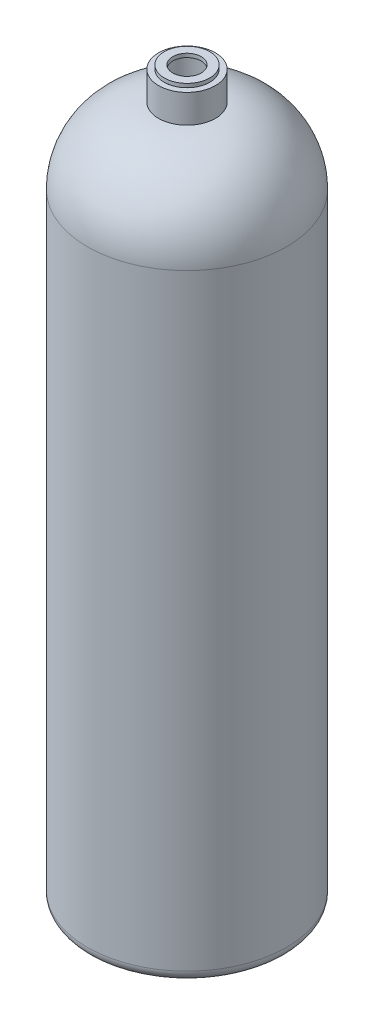
ISO-10303-21;
HEADER;
FILE_DESCRIPTION(('STEP AP214'),'2;1');
FILE_NAME('part.step','',(''),(''),'','','');
FILE_SCHEMA(('AUTOMOTIVE_DESIGN { 1 0 10303 214 1 1 1 1 }'));
ENDSEC;
DATA;
#1=APPLICATION_CONTEXT('core data for automotive mechanical design processes');
#2=APPLICATION_PROTOCOL_DEFINITION('international standard','automotive_design',2000,#1);
#3=PRODUCT_CONTEXT('',#1,'mechanical');
#4=PRODUCT('Part','Part','',(#3));
#5=PRODUCT_RELATED_PRODUCT_CATEGORY('part','',(#4));
#6=PRODUCT_DEFINITION_FORMATION('','',#4);
#7=PRODUCT_DEFINITION_CONTEXT('part definition',#1,'design');
#8=PRODUCT_DEFINITION('design','',#6,#7);
#9=PRODUCT_DEFINITION_SHAPE('','',#8);
#10=(LENGTH_UNIT() NAMED_UNIT(*) SI_UNIT(.MILLI.,.METRE.));
#11=(NAMED_UNIT(*) PLANE_ANGLE_UNIT() SI_UNIT($,.RADIAN.));
#12=(NAMED_UNIT(*) SI_UNIT($,.STERADIAN.) SOLID_ANGLE_UNIT());
#13=UNCERTAINTY_MEASURE_WITH_UNIT(LENGTH_MEASURE(1.E-05),#10,'distance_accuracy_value','');
#14=(GEOMETRIC_REPRESENTATION_CONTEXT(3) GLOBAL_UNCERTAINTY_ASSIGNED_CONTEXT((#13)) GLOBAL_UNIT_ASSIGNED_CONTEXT((#10,
#11,#12)) REPRESENTATION_CONTEXT('',''));
#15=CARTESIAN_POINT('',(0.,0.,0.));
#16=DIRECTION('',(0.,0.,1.));
#17=DIRECTION('',(1.,0.,0.));
#18=AXIS2_PLACEMENT_3D('',#15,#16,#17);
#19=CARTESIAN_POINT('',(0.,486.41,0.));
#20=DIRECTION('',(0.,1.,0.));
#21=DIRECTION('',(0.,0.,1.));
#22=AXIS2_PLACEMENT_3D('',#19,#20,#21);
#23=PLANE('',#22);
#24=CARTESIAN_POINT('',(0.,486.41,0.));
#25=DIRECTION('',(0.,1.,0.));
#26=DIRECTION('',(0.,0.,1.));
#27=AXIS2_PLACEMENT_3D('',#24,#25,#26);
#28=CIRCLE('',#27,15.24);
#29=CARTESIAN_POINT('',(0.,486.41,15.24));
#30=VERTEX_POINT('',#29);
#31=EDGE_CURVE('E11',#30,#30,#28,.T.);
#32=ORIENTED_EDGE('',*,*,#31,.T.);
#33=EDGE_LOOP('',(#32));
#34=FACE_BOUND('',#33,.T.);
#35=CARTESIAN_POINT('',(0.,486.41,0.));
#36=DIRECTION('',(0.,1.,0.));
#37=DIRECTION('',(0.,0.,1.));
#38=AXIS2_PLACEMENT_3D('',#35,#36,#37);
#39=CIRCLE('',#38,9.525);
#40=CARTESIAN_POINT('',(0.,486.41,9.525));
#41=VERTEX_POINT('',#40);
#42=EDGE_CURVE('E52',#41,#41,#39,.T.);
#43=ORIENTED_EDGE('',*,*,#42,.F.);
#44=EDGE_LOOP('',(#43));
#45=FACE_BOUND('',#44,.T.);
#46=ADVANCED_FACE('F41',(#34,#45),#23,.T.);
#47=CARTESIAN_POINT('',(0.,483.87,0.));
#48=DIRECTION('',(0.,1.,0.));
#49=DIRECTION('',(0.,0.,1.));
#50=AXIS2_PLACEMENT_3D('',#47,#48,#49);
#51=PLANE('',#50);
#52=CARTESIAN_POINT('',(0.,483.87,0.));
#53=DIRECTION('',(0.,1.,0.));
#54=DIRECTION('',(0.,0.,1.));
#55=AXIS2_PLACEMENT_3D('',#52,#53,#54);
#56=CIRCLE('',#55,15.24);
#57=CARTESIAN_POINT('',(0.,483.87,15.24));
#58=VERTEX_POINT('',#57);
#59=EDGE_CURVE('E45',#58,#58,#56,.T.);
#60=ORIENTED_EDGE('',*,*,#59,.F.);
#61=EDGE_LOOP('',(#60));
#62=FACE_BOUND('',#61,.T.);
#63=CARTESIAN_POINT('',(0.,483.87,0.));
#64=DIRECTION('',(0.,1.,0.));
#65=DIRECTION('',(0.,0.,1.));
#66=AXIS2_PLACEMENT_3D('',#63,#64,#65);
#67=CIRCLE('',#66,9.525);
#68=CARTESIAN_POINT('',(0.,483.87,9.525));
#69=VERTEX_POINT('',#68);
#70=EDGE_CURVE('E54',#69,#69,#67,.T.);
#71=ORIENTED_EDGE('',*,*,#70,.T.);
#72=EDGE_LOOP('',(#71));
#73=FACE_BOUND('',#72,.T.);
#74=ADVANCED_FACE('F64',(#62,#73),#51,.F.);
#75=CARTESIAN_POINT('',(0.,486.41,0.));
#76=DIRECTION('',(0.,-1.,0.));
#77=DIRECTION('',(0.,0.,-1.));
#78=AXIS2_PLACEMENT_3D('',#75,#76,#77);
#79=CYLINDRICAL_SURFACE('',#78,15.24);
#80=ORIENTED_EDGE('',*,*,#31,.F.);
#81=EDGE_LOOP('',(#80));
#82=FACE_BOUND('',#81,.T.);
#83=ORIENTED_EDGE('',*,*,#59,.T.);
#84=EDGE_LOOP('',(#83));
#85=FACE_BOUND('',#84,.T.);
#86=ADVANCED_FACE('F43',(#82,#85),#79,.T.);
#87=CARTESIAN_POINT('',(0.,486.41,0.));
#88=DIRECTION('',(0.,-1.,0.));
#89=DIRECTION('',(0.,0.,-1.));
#90=AXIS2_PLACEMENT_3D('',#87,#88,#89);
#91=CYLINDRICAL_SURFACE('',#90,9.525);
#92=ORIENTED_EDGE('',*,*,#42,.T.);
#93=EDGE_LOOP('',(#92));
#94=FACE_BOUND('',#93,.T.);
#95=ORIENTED_EDGE('',*,*,#70,.F.);
#96=EDGE_LOOP('',(#95));
#97=FACE_BOUND('',#96,.T.);
#98=ADVANCED_FACE('F60',(#94,#97),#91,.F.);
#99=CLOSED_SHELL('',(#46,#74,#86,#98));
#100=MANIFOLD_SOLID_BREP('B2',#99);
#101=CARTESIAN_POINT('',(0.,414.02,0.));
#102=DIRECTION('',(0.,-1.,0.));
#103=DIRECTION('',(0.,0.,-1.));
#104=AXIS2_PLACEMENT_3D('',#101,#102,#103);
#105=CYLINDRICAL_SURFACE('',#104,66.675);
#106=CARTESIAN_POINT('',(0.,7.62000000000002,0.));
#107=DIRECTION('',(0.,1.,0.));
#108=DIRECTION('',(0.,0.,1.));
#109=AXIS2_PLACEMENT_3D('',#106,#107,#108);
#110=CIRCLE('',#109,66.675);
#111=CARTESIAN_POINT('',(0.,7.62000000000002,66.675));
#112=VERTEX_POINT('',#111);
#113=EDGE_CURVE('E110',#112,#112,#110,.T.);
#114=ORIENTED_EDGE('',*,*,#113,.T.);
#115=EDGE_LOOP('',(#114));
#116=FACE_BOUND('',#115,.T.);
#117=CARTESIAN_POINT('',(0.,414.119315833019,0.));
#118=DIRECTION('',(0.,1.,0.));
#119=DIRECTION('',(0.,0.,1.));
#120=AXIS2_PLACEMENT_3D('',#117,#118,#119);
#121=CIRCLE('',#120,66.675);
#122=CARTESIAN_POINT('',(0.,414.119315833019,66.675));
#123=VERTEX_POINT('',#122);
#124=EDGE_CURVE('E114',#123,#123,#121,.F.);
#125=ORIENTED_EDGE('',*,*,#124,.T.);
#126=EDGE_LOOP('',(#125));
#127=FACE_BOUND('',#126,.T.);
#128=ADVANCED_FACE('F103',(#116,#127),#105,.T.);
#129=CARTESIAN_POINT('',(0.,0.,0.));
#130=DIRECTION('',(0.,1.,0.));
#131=DIRECTION('',(0.,0.,1.));
#132=AXIS2_PLACEMENT_3D('',#129,#130,#131);
#133=PLANE('',#132);
#134=CARTESIAN_POINT('',(0.,0.,0.));
#135=DIRECTION('',(0.,1.,0.));
#136=DIRECTION('',(0.,0.,1.));
#137=AXIS2_PLACEMENT_3D('',#134,#135,#136);
#138=CIRCLE('',#137,59.055);
#139=CARTESIAN_POINT('',(0.,0.,59.055));
#140=VERTEX_POINT('',#139);
#141=EDGE_CURVE('E40',#140,#140,#138,.F.);
#142=ORIENTED_EDGE('',*,*,#141,.T.);
#143=EDGE_LOOP('',(#142));
#144=FACE_BOUND('',#143,.T.);
#145=ADVANCED_FACE('F167',(#144),#133,.F.);
#146=CARTESIAN_POINT('',(0.,483.87,0.));
#147=DIRECTION('',(0.,-1.,0.));
#148=DIRECTION('',(0.,0.,-1.));
#149=AXIS2_PLACEMENT_3D('',#146,#147,#148);
#150=CYLINDRICAL_SURFACE('',#149,19.05);
#151=CARTESIAN_POINT('',(0.,483.87,0.));
#152=DIRECTION('',(0.,1.,0.));
#153=DIRECTION('',(0.,0.,1.));
#154=AXIS2_PLACEMENT_3D('',#151,#152,#153);
#155=CIRCLE('',#154,19.05);
#156=CARTESIAN_POINT('',(0.,483.87,-19.05));
#157=VERTEX_POINT('',#156);
#158=EDGE_CURVE('E118',#157,#157,#155,.T.);
#159=CARTESIAN_POINT('',(0.,464.82,0.));
#160=DIRECTION('',(0.,1.,0.));
#161=DIRECTION('',(0.,0.,1.));
#162=AXIS2_PLACEMENT_3D('',#159,#160,#161);
#163=CIRCLE('',#162,19.05);
#164=CARTESIAN_POINT('',(0.,464.82,-19.05));
#165=VERTEX_POINT('',#164);
#166=EDGE_CURVE('E121',#165,#165,#163,.T.);
#167=CARTESIAN_POINT('',(0.,483.87,-19.05));
#168=CARTESIAN_POINT('',(0.,483.6715625,-19.05));
#169=CARTESIAN_POINT('',(0.,483.473125,-19.05));
#170=CARTESIAN_POINT('',(0.,483.07625,-19.05));
#171=CARTESIAN_POINT('',(0.,482.8778125,-19.05));
#172=CARTESIAN_POINT('',(0.,482.4809375,-19.05));
#173=CARTESIAN_POINT('',(0.,482.2825,-19.05));
#174=CARTESIAN_POINT('',(0.,481.885625,-19.05));
#175=CARTESIAN_POINT('',(0.,481.6871875,-19.05));
#176=CARTESIAN_POINT('',(0.,481.2903125,-19.05));
#177=CARTESIAN_POINT('',(0.,481.091875,-19.05));
#178=CARTESIAN_POINT('',(0.,480.695,-19.05));
#179=CARTESIAN_POINT('',(0.,480.4965625,-19.05));
#180=CARTESIAN_POINT('',(0.,480.0996875,-19.05));
#181=CARTESIAN_POINT('',(0.,479.90125,-19.05));
#182=CARTESIAN_POINT('',(0.,479.504375,-19.05));
#183=CARTESIAN_POINT('',(0.,479.3059375,-19.05));
#184=CARTESIAN_POINT('',(0.,478.9090625,-19.05));
#185=CARTESIAN_POINT('',(0.,478.710625,-19.05));
#186=CARTESIAN_POINT('',(0.,478.31375,-19.05));
#187=CARTESIAN_POINT('',(0.,478.1153125,-19.05));
#188=CARTESIAN_POINT('',(0.,477.7184375,-19.05));
#189=CARTESIAN_POINT('',(0.,477.52,-19.05));
#190=CARTESIAN_POINT('',(0.,477.123125,-19.05));
#191=CARTESIAN_POINT('',(0.,476.9246875,-19.05));
#192=CARTESIAN_POINT('',(0.,476.5278125,-19.05));
#193=CARTESIAN_POINT('',(0.,476.329375,-19.05));
#194=CARTESIAN_POINT('',(0.,475.9325,-19.05));
#195=CARTESIAN_POINT('',(0.,475.7340625,-19.05));
#196=CARTESIAN_POINT('',(0.,475.3371875,-19.05));
#197=CARTESIAN_POINT('',(0.,475.13875,-19.05));
#198=CARTESIAN_POINT('',(0.,474.741875,-19.05));
#199=CARTESIAN_POINT('',(0.,474.5434375,-19.05));
#200=CARTESIAN_POINT('',(0.,474.1465625,-19.05));
#201=CARTESIAN_POINT('',(0.,473.948125,-19.05));
#202=CARTESIAN_POINT('',(0.,473.55125,-19.05));
#203=CARTESIAN_POINT('',(0.,473.3528125,-19.05));
#204=CARTESIAN_POINT('',(0.,472.9559375,-19.05));
#205=CARTESIAN_POINT('',(0.,472.7575,-19.05));
#206=CARTESIAN_POINT('',(0.,472.360625,-19.05));
#207=CARTESIAN_POINT('',(0.,472.1621875,-19.05));
#208=CARTESIAN_POINT('',(0.,471.7653125,-19.05));
#209=CARTESIAN_POINT('',(0.,471.566875,-19.05));
#210=CARTESIAN_POINT('',(0.,471.17,-19.05));
#211=CARTESIAN_POINT('',(0.,470.9715625,-19.05));
#212=CARTESIAN_POINT('',(0.,470.5746875,-19.05));
#213=CARTESIAN_POINT('',(0.,470.37625,-19.05));
#214=CARTESIAN_POINT('',(0.,469.979375,-19.05));
#215=CARTESIAN_POINT('',(0.,469.7809375,-19.05));
#216=CARTESIAN_POINT('',(0.,469.3840625,-19.05));
#217=CARTESIAN_POINT('',(0.,469.185625,-19.05));
#218=CARTESIAN_POINT('',(0.,468.78875,-19.05));
#219=CARTESIAN_POINT('',(0.,468.5903125,-19.05));
#220=CARTESIAN_POINT('',(0.,468.1934375,-19.05));
#221=CARTESIAN_POINT('',(0.,467.995,-19.05));
#222=CARTESIAN_POINT('',(0.,467.598125,-19.05));
#223=CARTESIAN_POINT('',(0.,467.3996875,-19.05));
#224=CARTESIAN_POINT('',(0.,467.0028125,-19.05));
#225=CARTESIAN_POINT('',(0.,466.804375,-19.05));
#226=CARTESIAN_POINT('',(0.,466.4075,-19.05));
#227=CARTESIAN_POINT('',(0.,466.2090625,-19.05));
#228=CARTESIAN_POINT('',(0.,465.8121875,-19.05));
#229=CARTESIAN_POINT('',(0.,465.61375,-19.05));
#230=CARTESIAN_POINT('',(0.,465.216875,-19.05));
#231=CARTESIAN_POINT('',(0.,465.0184375,-19.05));
#232=CARTESIAN_POINT('',(0.,464.82,-19.05));
#233=B_SPLINE_CURVE_WITH_KNOTS('',3,(#167,#168,#169,#170,#171,#172,#173,#174,#175,#176,#177,
#178,#179,#180,#181,#182,#183,#184,#185,#186,#187,#188,#189,#190,#191,#192,#193,#194,#195,#196,
#197,#198,#199,#200,#201,#202,#203,#204,#205,#206,#207,#208,#209,#210,#211,#212,#213,#214,#215,
#216,#217,#218,#219,#220,#221,#222,#223,#224,#225,#226,#227,#228,#229,#230,#231,#232),
.UNSPECIFIED.,.F.,.F.,(4,2,2,2,2,2,2,2,2,2,2,2,2,2,2,2,2,2,2,2,2,2,2,2,2,2,2,2,2,2,2,2,4),(0.,
0.595312500000056,1.19062500000006,1.78593750000006,2.38125000000006,2.97656250000006,
3.57187500000006,4.16718750000006,4.76250000000006,5.35781250000006,5.95312500000006,
6.54843750000006,7.14375000000006,7.73906250000006,8.33437500000006,8.92968750000006,
9.52500000000006,10.1203125000001,10.7156250000001,11.3109375000001,11.9062500000001,
12.5015625000001,13.0968750000001,13.6921875000001,14.2875000000001,14.8828125000001,
15.4781250000001,16.0734375000001,16.6687500000001,17.2640625000001,17.8593750000001,
18.4546875000001,19.0500000000001),.UNSPECIFIED.);
#234=EDGE_CURVE('BSEAM172',#157,#165,#233,.T.);
#235=ORIENTED_EDGE('',*,*,#158,.F.);
#236=ORIENTED_EDGE('',*,*,#166,.T.);
#237=ORIENTED_EDGE('',*,*,#234,.T.);
#238=ORIENTED_EDGE('',*,*,#234,.F.);
#239=EDGE_LOOP('',(#235,#237,#236,#238));
#240=FACE_BOUND('',#239,.T.);
#241=ADVANCED_FACE('F172',(#240),#150,.T.);
#242=CARTESIAN_POINT('',(0.,483.87,0.));
#243=DIRECTION('',(0.,1.,0.));
#244=DIRECTION('',(0.,0.,1.));
#245=AXIS2_PLACEMENT_3D('',#242,#243,#244);
#246=PLANE('',#245);
#247=CARTESIAN_POINT('',(0.,483.87,0.));
#248=DIRECTION('',(0.,1.,0.));
#249=DIRECTION('',(0.,0.,1.));
#250=AXIS2_PLACEMENT_3D('',#247,#248,#249);
#251=CIRCLE('',#250,15.24);
#252=CARTESIAN_POINT('',(0.,483.87,-15.24));
#253=VERTEX_POINT('',#252);
#254=EDGE_CURVE('E127',#253,#253,#251,.T.);
#255=ORIENTED_EDGE('',*,*,#254,.F.);
#256=EDGE_LOOP('',(#255));
#257=FACE_BOUND('',#256,.T.);
#258=ORIENTED_EDGE('',*,*,#158,.T.);
#259=EDGE_LOOP('',(#258));
#260=FACE_BOUND('',#259,.T.);
#261=ADVANCED_FACE('F178',(#257,#260),#246,.T.);
#262=CARTESIAN_POINT('',(0.,414.119315833019,0.));
#263=DIRECTION('',(0.,1.,0.));
#264=DIRECTION('',(0.,0.,1.));
#265=AXIS2_PLACEMENT_3D('',#262,#263,#264);
#266=DEGENERATE_TOROIDAL_SURFACE('',#265,15.875,50.8,.T.);
#267=ORIENTED_EDGE('',*,*,#124,.F.);
#268=EDGE_LOOP('',(#267));
#269=FACE_BOUND('',#268,.T.);
#270=ORIENTED_EDGE('',*,*,#166,.F.);
#271=EDGE_LOOP('',(#270));
#272=FACE_BOUND('',#271,.T.);
#273=ADVANCED_FACE('F176',(#269,#272),#266,.T.);
#274=CARTESIAN_POINT('',(0.,7.62000000000002,0.));
#275=DIRECTION('',(0.,1.,0.));
#276=DIRECTION('',(0.,0.,1.));
#277=AXIS2_PLACEMENT_3D('',#274,#275,#276);
#278=TOROIDAL_SURFACE('',#277,59.055,7.62);
#279=ORIENTED_EDGE('',*,*,#141,.F.);
#280=EDGE_LOOP('',(#279));
#281=FACE_BOUND('',#280,.T.);
#282=ORIENTED_EDGE('',*,*,#113,.F.);
#283=EDGE_LOOP('',(#282));
#284=FACE_BOUND('',#283,.T.);
#285=ADVANCED_FACE('F105',(#281,#284),#278,.T.);
#286=CARTESIAN_POINT('',(0.,414.02,0.));
#287=DIRECTION('',(0.,-1.,0.));
#288=DIRECTION('',(0.,0.,-1.));
#289=AXIS2_PLACEMENT_3D('',#286,#287,#288);
#290=CYLINDRICAL_SURFACE('',#289,62.865);
#291=CARTESIAN_POINT('',(0.,7.62000000000002,0.));
#292=DIRECTION('',(0.,-1.,0.));
#293=DIRECTION('',(0.,0.,-1.));
#294=AXIS2_PLACEMENT_3D('',#291,#292,#293);
#295=CIRCLE('',#294,62.865);
#296=CARTESIAN_POINT('',(0.,7.62000000000002,-62.865));
#297=VERTEX_POINT('',#296);
#298=EDGE_CURVE('E134',#297,#297,#295,.F.);
#299=ORIENTED_EDGE('',*,*,#298,.F.);
#300=EDGE_LOOP('',(#299));
#301=FACE_BOUND('',#300,.T.);
#302=CARTESIAN_POINT('',(0.,414.119315833019,0.));
#303=DIRECTION('',(0.,-1.,0.));
#304=DIRECTION('',(0.,0.,-1.));
#305=AXIS2_PLACEMENT_3D('',#302,#303,#304);
#306=CIRCLE('',#305,62.865);
#307=CARTESIAN_POINT('',(0.,414.119315833019,-62.865));
#308=VERTEX_POINT('',#307);
#309=EDGE_CURVE('E130',#308,#308,#306,.T.);
#310=ORIENTED_EDGE('',*,*,#309,.F.);
#311=EDGE_LOOP('',(#310));
#312=FACE_BOUND('',#311,.T.);
#313=ADVANCED_FACE('F144',(#301,#312),#290,.F.);
#314=CARTESIAN_POINT('',(0.,3.81,0.));
#315=DIRECTION('',(0.,1.,0.));
#316=DIRECTION('',(0.,0.,1.));
#317=AXIS2_PLACEMENT_3D('',#314,#315,#316);
#318=PLANE('',#317);
#319=CARTESIAN_POINT('',(0.,3.81000000000002,0.));
#320=DIRECTION('',(0.,1.,0.));
#321=DIRECTION('',(0.,0.,1.));
#322=AXIS2_PLACEMENT_3D('',#319,#320,#321);
#323=CIRCLE('',#322,59.055);
#324=CARTESIAN_POINT('',(0.,3.81000000000002,59.055));
#325=VERTEX_POINT('',#324);
#326=EDGE_CURVE('E124',#325,#325,#323,.F.);
#327=ORIENTED_EDGE('',*,*,#326,.F.);
#328=EDGE_LOOP('',(#327));
#329=FACE_BOUND('',#328,.T.);
#330=ADVANCED_FACE('F147',(#329),#318,.T.);
#331=CARTESIAN_POINT('',(0.,483.87,0.));
#332=DIRECTION('',(0.,-1.,0.));
#333=DIRECTION('',(0.,0.,-1.));
#334=AXIS2_PLACEMENT_3D('',#331,#332,#333);
#335=CYLINDRICAL_SURFACE('',#334,15.24);
#336=CARTESIAN_POINT('',(0.,461.105025096581,0.));
#337=DIRECTION('',(0.,-1.,0.));
#338=DIRECTION('',(0.,0.,-1.));
#339=AXIS2_PLACEMENT_3D('',#336,#337,#338);
#340=CIRCLE('',#339,15.24);
#341=CARTESIAN_POINT('',(0.,461.105025096581,-15.24));
#342=VERTEX_POINT('',#341);
#343=EDGE_CURVE('E131',#342,#342,#340,.F.);
#344=CARTESIAN_POINT('',(0.,483.87,-15.24));
#345=CARTESIAN_POINT('',(0.,483.632864844756,-15.24));
#346=CARTESIAN_POINT('',(0.,483.395729689512,-15.24));
#347=CARTESIAN_POINT('',(0.,482.921459379024,-15.24));
#348=CARTESIAN_POINT('',(0.,482.68432422378,-15.24));
#349=CARTESIAN_POINT('',(0.,482.210053913292,-15.24));
#350=CARTESIAN_POINT('',(0.,481.972918758048,-15.24));
#351=CARTESIAN_POINT('',(0.,481.498648447561,-15.24));
#352=CARTESIAN_POINT('',(0.,481.261513292317,-15.24));
#353=CARTESIAN_POINT('',(0.,480.787242981829,-15.24));
#354=CARTESIAN_POINT('',(0.,480.550107826585,-15.24));
#355=CARTESIAN_POINT('',(0.,480.075837516097,-15.24));
#356=CARTESIAN_POINT('',(0.,479.838702360853,-15.24));
#357=CARTESIAN_POINT('',(0.,479.364432050365,-15.24));
#358=CARTESIAN_POINT('',(0.,479.127296895121,-15.24));
#359=CARTESIAN_POINT('',(0.,478.653026584633,-15.24));
#360=CARTESIAN_POINT('',(0.,478.415891429389,-15.24));
#361=CARTESIAN_POINT('',(0.,477.941621118901,-15.24));
#362=CARTESIAN_POINT('',(0.,477.704485963657,-15.24));
#363=CARTESIAN_POINT('',(0.,477.230215653169,-15.24));
#364=CARTESIAN_POINT('',(0.,476.993080497925,-15.24));
#365=CARTESIAN_POINT('',(0.,476.518810187438,-15.24));
#366=CARTESIAN_POINT('',(0.,476.281675032194,-15.24));
#367=CARTESIAN_POINT('',(0.,475.807404721706,-15.24));
#368=CARTESIAN_POINT('',(0.,475.570269566462,-15.24));
#369=CARTESIAN_POINT('',(0.,475.095999255974,-15.24));
#370=CARTESIAN_POINT('',(0.,474.85886410073,-15.24));
#371=CARTESIAN_POINT('',(0.,474.384593790242,-15.24));
#372=CARTESIAN_POINT('',(0.,474.147458634998,-15.24));
#373=CARTESIAN_POINT('',(0.,473.67318832451,-15.24));
#374=CARTESIAN_POINT('',(0.,473.436053169266,-15.24));
#375=CARTESIAN_POINT('',(0.,472.961782858778,-15.24));
#376=CARTESIAN_POINT('',(0.,472.724647703534,-15.24));
#377=CARTESIAN_POINT('',(0.,472.250377393047,-15.24));
#378=CARTESIAN_POINT('',(0.,472.013242237803,-15.24));
#379=CARTESIAN_POINT('',(0.,471.538971927315,-15.24));
#380=CARTESIAN_POINT('',(0.,471.301836772071,-15.24));
#381=CARTESIAN_POINT('',(0.,470.827566461583,-15.24));
#382=CARTESIAN_POINT('',(0.,470.590431306339,-15.24));
#383=CARTESIAN_POINT('',(0.,470.116160995851,-15.24));
#384=CARTESIAN_POINT('',(0.,469.879025840607,-15.24));
#385=CARTESIAN_POINT('',(0.,469.404755530119,-15.24));
#386=CARTESIAN_POINT('',(0.,469.167620374875,-15.24));
#387=CARTESIAN_POINT('',(0.,468.693350064387,-15.24));
#388=CARTESIAN_POINT('',(0.,468.456214909143,-15.24));
#389=CARTESIAN_POINT('',(0.,467.981944598655,-15.24));
#390=CARTESIAN_POINT('',(0.,467.744809443411,-15.24));
#391=CARTESIAN_POINT('',(0.,467.270539132924,-15.24));
#392=CARTESIAN_POINT('',(0.,467.03340397768,-15.24));
#393=CARTESIAN_POINT('',(0.,466.559133667192,-15.24));
#394=CARTESIAN_POINT('',(0.,466.321998511948,-15.24));
#395=CARTESIAN_POINT('',(0.,465.84772820146,-15.24));
#396=CARTESIAN_POINT('',(0.,465.610593046216,-15.24));
#397=CARTESIAN_POINT('',(0.,465.136322735728,-15.24));
#398=CARTESIAN_POINT('',(0.,464.899187580484,-15.24));
#399=CARTESIAN_POINT('',(0.,464.424917269996,-15.24));
#400=CARTESIAN_POINT('',(0.,464.187782114752,-15.24));
#401=CARTESIAN_POINT('',(0.,463.713511804264,-15.24));
#402=CARTESIAN_POINT('',(0.,463.47637664902,-15.24));
#403=CARTESIAN_POINT('',(0.,463.002106338532,-15.24));
#404=CARTESIAN_POINT('',(0.,462.764971183289,-15.24));
#405=CARTESIAN_POINT('',(0.,462.290700872801,-15.24));
#406=CARTESIAN_POINT('',(0.,462.053565717557,-15.24));
#407=CARTESIAN_POINT('',(0.,461.579295407069,-15.24));
#408=CARTESIAN_POINT('',(0.,461.342160251825,-15.24));
#409=CARTESIAN_POINT('',(0.,461.105025096581,-15.24));
#410=B_SPLINE_CURVE_WITH_KNOTS('',3,(#344,#345,#346,#347,#348,#349,#350,#351,#352,#353,#354,
#355,#356,#357,#358,#359,#360,#361,#362,#363,#364,#365,#366,#367,#368,#369,#370,#371,#372,#373,
#374,#375,#376,#377,#378,#379,#380,#381,#382,#383,#384,#385,#386,#387,#388,#389,#390,#391,#392,
#393,#394,#395,#396,#397,#398,#399,#400,#401,#402,#403,#404,#405,#406,#407,#408,#409),
.UNSPECIFIED.,.F.,.F.,(4,2,2,2,2,2,2,2,2,2,2,2,2,2,2,2,2,2,2,2,2,2,2,2,2,2,2,2,2,2,2,2,4),(0.,
0.71140546573184,1.42281093146368,2.13421639719552,2.84562186292736,3.5570273286592,
4.26843279439104,4.97983826012288,5.69124372585478,6.40264919158662,7.11405465731846,
7.8254601230503,8.53686558878214,9.24827105451398,9.95967652024582,10.6710819859777,
11.3824874517096,12.0938929174414,12.8052983831732,13.5167038489051,14.2281093146369,
14.9395147803688,15.6509202461006,16.3623257118324,17.0737311775643,17.7851366432962,
18.496542109028,19.2079475747599,19.9193530404917,20.6307585062235,21.3421639719554,
22.0535694376872,22.7649749034191),.UNSPECIFIED.);
#411=EDGE_CURVE('BSEAM154',#253,#342,#410,.T.);
#412=ORIENTED_EDGE('',*,*,#254,.T.);
#413=ORIENTED_EDGE('',*,*,#343,.F.);
#414=ORIENTED_EDGE('',*,*,#411,.T.);
#415=ORIENTED_EDGE('',*,*,#411,.F.);
#416=EDGE_LOOP('',(#412,#414,#413,#415));
#417=FACE_BOUND('',#416,.T.);
#418=ADVANCED_FACE('F154',(#417),#335,.F.);
#419=CARTESIAN_POINT('',(0.,414.119315833019,0.));
#420=DIRECTION('',(0.,1.,0.));
#421=DIRECTION('',(0.,0.,1.));
#422=AXIS2_PLACEMENT_3D('',#419,#420,#421);
#423=DEGENERATE_TOROIDAL_SURFACE('',#422,15.875,46.99,.T.);
#424=ORIENTED_EDGE('',*,*,#309,.T.);
#425=EDGE_LOOP('',(#424));
#426=FACE_BOUND('',#425,.T.);
#427=ORIENTED_EDGE('',*,*,#343,.T.);
#428=EDGE_LOOP('',(#427));
#429=FACE_BOUND('',#428,.T.);
#430=ADVANCED_FACE('F151',(#426,#429),#423,.F.);
#431=CARTESIAN_POINT('',(0.,7.62000000000002,0.));
#432=DIRECTION('',(0.,1.,0.));
#433=DIRECTION('',(0.,0.,1.));
#434=AXIS2_PLACEMENT_3D('',#431,#432,#433);
#435=TOROIDAL_SURFACE('',#434,59.055,3.81);
#436=ORIENTED_EDGE('',*,*,#326,.T.);
#437=EDGE_LOOP('',(#436));
#438=FACE_BOUND('',#437,.T.);
#439=ORIENTED_EDGE('',*,*,#298,.T.);
#440=EDGE_LOOP('',(#439));
#441=FACE_BOUND('',#440,.T.);
#442=ADVANCED_FACE('F142',(#438,#441),#435,.F.);
#443=CLOSED_SHELL('',(#128,#145,#241,#261,#273,#285,#313,#330,#418,#430,#442));
#444=MANIFOLD_SOLID_BREP('B6',#443);
#445=ADVANCED_BREP_SHAPE_REPRESENTATION('',(#18,#100,#444),#14);
#446=SHAPE_DEFINITION_REPRESENTATION(#9,#445);
ENDSEC;
END-ISO-10303-21;
